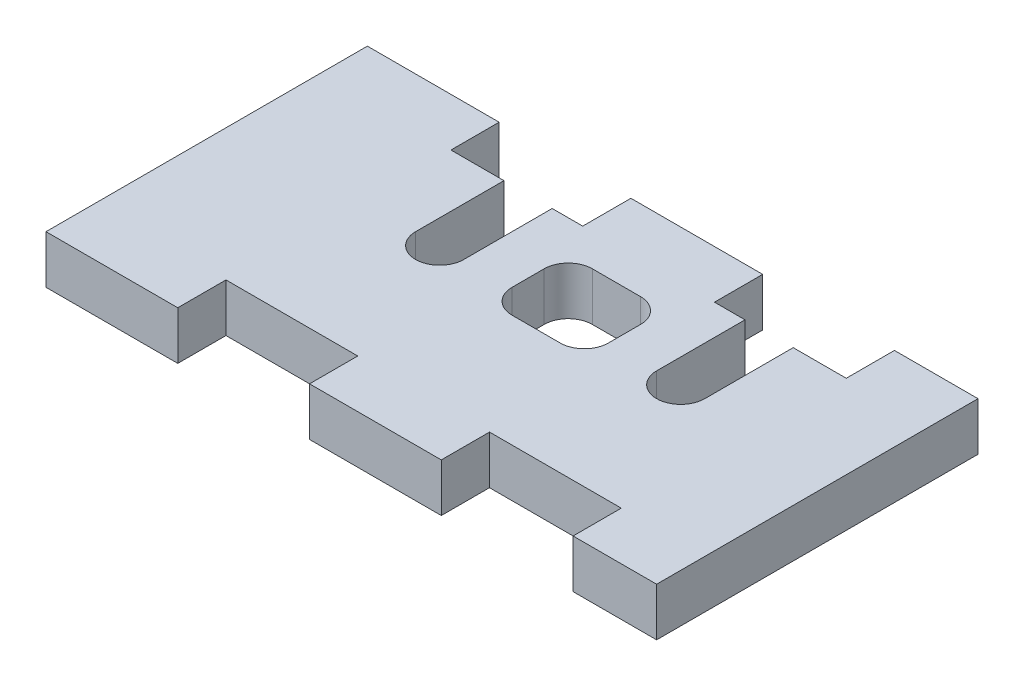
ISO-10303-21;
HEADER;
FILE_DESCRIPTION(('STEP AP214'),'2;1');
FILE_NAME('part.step','',(''),(''),'','','');
FILE_SCHEMA(('AUTOMOTIVE_DESIGN { 1 0 10303 214 1 1 1 1 }'));
ENDSEC;
DATA;
#1=APPLICATION_CONTEXT('core data for automotive mechanical design processes');
#2=APPLICATION_PROTOCOL_DEFINITION('international standard','automotive_design',2000,#1);
#3=PRODUCT_CONTEXT('',#1,'mechanical');
#4=PRODUCT('Part','Part','',(#3));
#5=PRODUCT_RELATED_PRODUCT_CATEGORY('part','',(#4));
#6=PRODUCT_DEFINITION_FORMATION('','',#4);
#7=PRODUCT_DEFINITION_CONTEXT('part definition',#1,'design');
#8=PRODUCT_DEFINITION('design','',#6,#7);
#9=PRODUCT_DEFINITION_SHAPE('','',#8);
#10=(LENGTH_UNIT() NAMED_UNIT(*) SI_UNIT(.MILLI.,.METRE.));
#11=(NAMED_UNIT(*) PLANE_ANGLE_UNIT() SI_UNIT($,.RADIAN.));
#12=(NAMED_UNIT(*) SI_UNIT($,.STERADIAN.) SOLID_ANGLE_UNIT());
#13=UNCERTAINTY_MEASURE_WITH_UNIT(LENGTH_MEASURE(1.E-05),#10,'distance_accuracy_value','');
#14=(GEOMETRIC_REPRESENTATION_CONTEXT(3) GLOBAL_UNCERTAINTY_ASSIGNED_CONTEXT((#13)) GLOBAL_UNIT_ASSIGNED_CONTEXT((#10,
#11,#12)) REPRESENTATION_CONTEXT('',''));
#15=CARTESIAN_POINT('',(0.,0.,0.));
#16=DIRECTION('',(0.,0.,1.));
#17=DIRECTION('',(1.,0.,0.));
#18=AXIS2_PLACEMENT_3D('',#15,#16,#17);
#19=CARTESIAN_POINT('',(24.599646,3.,-17.000006));
#20=DIRECTION('',(0.,0.,1.));
#21=DIRECTION('',(1.,0.,0.));
#22=AXIS2_PLACEMENT_3D('',#19,#20,#21);
#23=PLANE('',#22);
#24=DIRECTION('',(-1.,0.,0.));
#25=VECTOR('',#24,1.);
#26=CARTESIAN_POINT('',(24.599646,3.,-17.000006));
#27=LINE('',#26,#25);
#28=CARTESIAN_POINT('',(26.499959,3.,-17.000006));
#29=VERTEX_POINT('',#28);
#30=CARTESIAN_POINT('',(24.599646,3.,-17.000006));
#31=VERTEX_POINT('',#30);
#32=EDGE_CURVE('E421',#29,#31,#27,.T.);
#33=ORIENTED_EDGE('',*,*,#32,.F.);
#34=DIRECTION('',(0.,1.,0.));
#35=VECTOR('',#34,1.);
#36=CARTESIAN_POINT('',(26.499959,3.001,-17.000006));
#37=LINE('',#36,#35);
#38=CARTESIAN_POINT('',(26.499959,0.,-17.000006));
#39=VERTEX_POINT('',#38);
#40=EDGE_CURVE('E562',#39,#29,#37,.T.);
#41=ORIENTED_EDGE('',*,*,#40,.F.);
#42=DIRECTION('',(-1.,0.,0.));
#43=VECTOR('',#42,1.);
#44=CARTESIAN_POINT('',(24.599646,0.,-17.000006));
#45=LINE('',#44,#43);
#46=CARTESIAN_POINT('',(24.599646,0.,-17.000006));
#47=VERTEX_POINT('',#46);
#48=EDGE_CURVE('E325',#39,#47,#45,.T.);
#49=ORIENTED_EDGE('',*,*,#48,.T.);
#50=DIRECTION('',(0.,-1.,0.));
#51=VECTOR('',#50,1.);
#52=CARTESIAN_POINT('',(24.599646,3.,-17.000006));
#53=LINE('',#52,#51);
#54=EDGE_CURVE('E467',#31,#47,#53,.T.);
#55=ORIENTED_EDGE('',*,*,#54,.F.);
#56=EDGE_LOOP('',(#33,#41,#49,#55));
#57=FACE_BOUND('',#56,.T.);
#58=ADVANCED_FACE('F33',(#57),#23,.F.);
#59=CARTESIAN_POINT('',(8.19937400000001,3.,-17.000006));
#60=DIRECTION('',(0.,0.,1.));
#61=DIRECTION('',(1.,0.,0.));
#62=AXIS2_PLACEMENT_3D('',#59,#60,#61);
#63=PLANE('',#62);
#64=DIRECTION('',(-1.,0.,0.));
#65=VECTOR('',#64,1.);
#66=CARTESIAN_POINT('',(8.19937400000001,0.,-17.000006));
#67=LINE('',#66,#65);
#68=CARTESIAN_POINT('',(16.400272,0.,-17.000006));
#69=VERTEX_POINT('',#68);
#70=CARTESIAN_POINT('',(14.499959,0.,-17.000006));
#71=VERTEX_POINT('',#70);
#72=EDGE_CURVE('E292',#69,#71,#67,.T.);
#73=ORIENTED_EDGE('',*,*,#72,.T.);
#74=DIRECTION('',(0.,-1.,0.));
#75=VECTOR('',#74,1.);
#76=CARTESIAN_POINT('',(14.499959,3.001,-17.000006));
#77=LINE('',#76,#75);
#78=CARTESIAN_POINT('',(14.499959,3.,-17.000006));
#79=VERTEX_POINT('',#78);
#80=EDGE_CURVE('E283',#79,#71,#77,.T.);
#81=ORIENTED_EDGE('',*,*,#80,.F.);
#82=DIRECTION('',(-1.,0.,0.));
#83=VECTOR('',#82,1.);
#84=CARTESIAN_POINT('',(8.19937400000001,3.,-17.000006));
#85=LINE('',#84,#83);
#86=CARTESIAN_POINT('',(16.400272,3.,-17.000006));
#87=VERTEX_POINT('',#86);
#88=EDGE_CURVE('E431',#87,#79,#85,.T.);
#89=ORIENTED_EDGE('',*,*,#88,.F.);
#90=DIRECTION('',(0.,-1.,0.));
#91=VECTOR('',#90,1.);
#92=CARTESIAN_POINT('',(16.400272,3.,-17.000006));
#93=LINE('',#92,#91);
#94=EDGE_CURVE('E458',#87,#69,#93,.T.);
#95=ORIENTED_EDGE('',*,*,#94,.T.);
#96=EDGE_LOOP('',(#73,#81,#89,#95));
#97=FACE_BOUND('',#96,.T.);
#98=ADVANCED_FACE('F668',(#97),#63,.F.);
#99=CARTESIAN_POINT('',(0.,3.,0.));
#100=DIRECTION('',(1.,0.,0.));
#101=DIRECTION('',(0.,0.,-1.));
#102=AXIS2_PLACEMENT_3D('',#99,#100,#101);
#103=PLANE('',#102);
#104=DIRECTION('',(0.,0.,1.));
#105=VECTOR('',#104,1.);
#106=CARTESIAN_POINT('',(0.,0.,0.));
#107=LINE('',#106,#105);
#108=CARTESIAN_POINT('',(0.,0.,-20.));
#109=VERTEX_POINT('',#108);
#110=CARTESIAN_POINT('',(0.,0.,0.));
#111=VERTEX_POINT('',#110);
#112=EDGE_CURVE('E392',#109,#111,#107,.T.);
#113=ORIENTED_EDGE('',*,*,#112,.T.);
#114=DIRECTION('',(0.,-1.,0.));
#115=VECTOR('',#114,1.);
#116=CARTESIAN_POINT('',(0.,3.,0.));
#117=LINE('',#116,#115);
#118=CARTESIAN_POINT('',(0.,3.,0.));
#119=VERTEX_POINT('',#118);
#120=EDGE_CURVE('E12',#119,#111,#117,.T.);
#121=ORIENTED_EDGE('',*,*,#120,.F.);
#122=DIRECTION('',(0.,0.,1.));
#123=VECTOR('',#122,1.);
#124=CARTESIAN_POINT('',(0.,3.,0.));
#125=LINE('',#124,#123);
#126=CARTESIAN_POINT('',(0.,3.,-20.));
#127=VERTEX_POINT('',#126);
#128=EDGE_CURVE('E393',#127,#119,#125,.T.);
#129=ORIENTED_EDGE('',*,*,#128,.F.);
#130=DIRECTION('',(0.,-1.,0.));
#131=VECTOR('',#130,1.);
#132=CARTESIAN_POINT('',(0.,3.,-20.));
#133=LINE('',#132,#131);
#134=EDGE_CURVE('E438',#127,#109,#133,.T.);
#135=ORIENTED_EDGE('',*,*,#134,.T.);
#136=EDGE_LOOP('',(#113,#121,#129,#135));
#137=FACE_BOUND('',#136,.T.);
#138=ADVANCED_FACE('F35',(#137),#103,.F.);
#139=CARTESIAN_POINT('',(0.,3.,0.));
#140=DIRECTION('',(0.,0.,-1.));
#141=DIRECTION('',(-1.,0.,0.));
#142=AXIS2_PLACEMENT_3D('',#139,#140,#141);
#143=PLANE('',#142);
#144=DIRECTION('',(1.,0.,0.));
#145=VECTOR('',#144,1.);
#146=CARTESIAN_POINT('',(0.,0.,0.));
#147=LINE('',#146,#145);
#148=CARTESIAN_POINT('',(8.19937400000001,0.,0.));
#149=VERTEX_POINT('',#148);
#150=EDGE_CURVE('E442',#111,#149,#147,.T.);
#151=ORIENTED_EDGE('',*,*,#150,.T.);
#152=DIRECTION('',(0.,-1.,0.));
#153=VECTOR('',#152,1.);
#154=CARTESIAN_POINT('',(8.19937400000001,3.,0.));
#155=LINE('',#154,#153);
#156=CARTESIAN_POINT('',(8.19937400000001,3.,0.));
#157=VERTEX_POINT('',#156);
#158=EDGE_CURVE('E41',#157,#149,#155,.T.);
#159=ORIENTED_EDGE('',*,*,#158,.F.);
#160=DIRECTION('',(1.,0.,0.));
#161=VECTOR('',#160,1.);
#162=CARTESIAN_POINT('',(0.,3.,0.));
#163=LINE('',#162,#161);
#164=EDGE_CURVE('E396',#119,#157,#163,.T.);
#165=ORIENTED_EDGE('',*,*,#164,.F.);
#166=ORIENTED_EDGE('',*,*,#120,.T.);
#167=EDGE_LOOP('',(#151,#159,#165,#166));
#168=FACE_BOUND('',#167,.T.);
#169=ADVANCED_FACE('F979',(#168),#143,.F.);
#170=CARTESIAN_POINT('',(8.19937400000001,3.,-3.00024800000001));
#171=DIRECTION('',(-1.,0.,0.));
#172=DIRECTION('',(0.,0.,1.));
#173=AXIS2_PLACEMENT_3D('',#170,#171,#172);
#174=PLANE('',#173);
#175=DIRECTION('',(0.,0.,-1.));
#176=VECTOR('',#175,1.);
#177=CARTESIAN_POINT('',(8.19937400000001,0.,-3.00024800000001));
#178=LINE('',#177,#176);
#179=CARTESIAN_POINT('',(8.19937400000001,0.,-3.00024800000001));
#180=VERTEX_POINT('',#179);
#181=EDGE_CURVE('E509',#149,#180,#178,.T.);
#182=ORIENTED_EDGE('',*,*,#181,.T.);
#183=DIRECTION('',(0.,-1.,0.));
#184=VECTOR('',#183,1.);
#185=CARTESIAN_POINT('',(8.19937400000001,3.,-3.00024800000001));
#186=LINE('',#185,#184);
#187=CARTESIAN_POINT('',(8.19937400000001,3.,-3.00024800000001));
#188=VERTEX_POINT('',#187);
#189=EDGE_CURVE('E500',#188,#180,#186,.T.);
#190=ORIENTED_EDGE('',*,*,#189,.F.);
#191=DIRECTION('',(0.,0.,-1.));
#192=VECTOR('',#191,1.);
#193=CARTESIAN_POINT('',(8.19937400000001,3.,-3.00024800000001));
#194=LINE('',#193,#192);
#195=EDGE_CURVE('E399',#157,#188,#194,.T.);
#196=ORIENTED_EDGE('',*,*,#195,.F.);
#197=ORIENTED_EDGE('',*,*,#158,.T.);
#198=EDGE_LOOP('',(#182,#190,#196,#197));
#199=FACE_BOUND('',#198,.T.);
#200=ADVANCED_FACE('F507',(#199),#174,.F.);
#201=CARTESIAN_POINT('',(8.19937400000001,3.,-3.00024800000001));
#202=DIRECTION('',(0.,0.,-1.));
#203=DIRECTION('',(-1.,0.,0.));
#204=AXIS2_PLACEMENT_3D('',#201,#202,#203);
#205=PLANE('',#204);
#206=DIRECTION('',(1.,0.,0.));
#207=VECTOR('',#206,1.);
#208=CARTESIAN_POINT('',(8.19937400000001,0.,-3.00024800000001));
#209=LINE('',#208,#207);
#210=CARTESIAN_POINT('',(16.400272,0.,-3.00024800000001));
#211=VERTEX_POINT('',#210);
#212=EDGE_CURVE('E514',#180,#211,#209,.T.);
#213=ORIENTED_EDGE('',*,*,#212,.T.);
#214=DIRECTION('',(0.,-1.,0.));
#215=VECTOR('',#214,1.);
#216=CARTESIAN_POINT('',(16.400272,3.,-3.00024800000001));
#217=LINE('',#216,#215);
#218=CARTESIAN_POINT('',(16.400272,3.,-3.00024800000001));
#219=VERTEX_POINT('',#218);
#220=EDGE_CURVE('E497',#219,#211,#217,.T.);
#221=ORIENTED_EDGE('',*,*,#220,.F.);
#222=DIRECTION('',(1.,0.,0.));
#223=VECTOR('',#222,1.);
#224=CARTESIAN_POINT('',(8.19937400000001,3.,-3.00024800000001));
#225=LINE('',#224,#223);
#226=EDGE_CURVE('E401',#188,#219,#225,.T.);
#227=ORIENTED_EDGE('',*,*,#226,.F.);
#228=ORIENTED_EDGE('',*,*,#189,.T.);
#229=EDGE_LOOP('',(#213,#221,#227,#228));
#230=FACE_BOUND('',#229,.T.);
#231=ADVANCED_FACE('F962',(#230),#205,.F.);
#232=CARTESIAN_POINT('',(16.400272,3.,-3.00024800000001));
#233=DIRECTION('',(1.,0.,0.));
#234=DIRECTION('',(0.,0.,-1.));
#235=AXIS2_PLACEMENT_3D('',#232,#233,#234);
#236=PLANE('',#235);
#237=DIRECTION('',(0.,0.,1.));
#238=VECTOR('',#237,1.);
#239=CARTESIAN_POINT('',(16.400272,0.,-3.00024800000001));
#240=LINE('',#239,#238);
#241=CARTESIAN_POINT('',(16.400272,0.,0.));
#242=VERTEX_POINT('',#241);
#243=EDGE_CURVE('E515',#211,#242,#240,.T.);
#244=ORIENTED_EDGE('',*,*,#243,.T.);
#245=DIRECTION('',(0.,-1.,0.));
#246=VECTOR('',#245,1.);
#247=CARTESIAN_POINT('',(16.400272,3.,0.));
#248=LINE('',#247,#246);
#249=CARTESIAN_POINT('',(16.400272,3.,0.));
#250=VERTEX_POINT('',#249);
#251=EDGE_CURVE('E494',#250,#242,#248,.T.);
#252=ORIENTED_EDGE('',*,*,#251,.F.);
#253=DIRECTION('',(0.,0.,1.));
#254=VECTOR('',#253,1.);
#255=CARTESIAN_POINT('',(16.400272,3.,-3.00024800000001));
#256=LINE('',#255,#254);
#257=EDGE_CURVE('E403',#219,#250,#256,.T.);
#258=ORIENTED_EDGE('',*,*,#257,.F.);
#259=ORIENTED_EDGE('',*,*,#220,.T.);
#260=EDGE_LOOP('',(#244,#252,#258,#259));
#261=FACE_BOUND('',#260,.T.);
#262=ADVANCED_FACE('F953',(#261),#236,.F.);
#263=CARTESIAN_POINT('',(16.400272,3.,0.));
#264=DIRECTION('',(0.,0.,-1.));
#265=DIRECTION('',(-1.,0.,0.));
#266=AXIS2_PLACEMENT_3D('',#263,#264,#265);
#267=PLANE('',#266);
#268=DIRECTION('',(1.,0.,0.));
#269=VECTOR('',#268,1.);
#270=CARTESIAN_POINT('',(16.400272,0.,0.));
#271=LINE('',#270,#269);
#272=CARTESIAN_POINT('',(24.599646,0.,0.));
#273=VERTEX_POINT('',#272);
#274=EDGE_CURVE('E526',#242,#273,#271,.T.);
#275=ORIENTED_EDGE('',*,*,#274,.T.);
#276=DIRECTION('',(0.,-1.,0.));
#277=VECTOR('',#276,1.);
#278=CARTESIAN_POINT('',(24.599646,3.,0.));
#279=LINE('',#278,#277);
#280=CARTESIAN_POINT('',(24.599646,3.,0.));
#281=VERTEX_POINT('',#280);
#282=EDGE_CURVE('E491',#281,#273,#279,.T.);
#283=ORIENTED_EDGE('',*,*,#282,.F.);
#284=DIRECTION('',(1.,0.,0.));
#285=VECTOR('',#284,1.);
#286=CARTESIAN_POINT('',(16.400272,3.,0.));
#287=LINE('',#286,#285);
#288=EDGE_CURVE('E405',#250,#281,#287,.T.);
#289=ORIENTED_EDGE('',*,*,#288,.F.);
#290=ORIENTED_EDGE('',*,*,#251,.T.);
#291=EDGE_LOOP('',(#275,#283,#289,#290));
#292=FACE_BOUND('',#291,.T.);
#293=ADVANCED_FACE('F944',(#292),#267,.F.);
#294=CARTESIAN_POINT('',(24.599646,3.,-3.00024800000001));
#295=DIRECTION('',(-1.,0.,0.));
#296=DIRECTION('',(0.,0.,1.));
#297=AXIS2_PLACEMENT_3D('',#294,#295,#296);
#298=PLANE('',#297);
#299=DIRECTION('',(0.,0.,-1.));
#300=VECTOR('',#299,1.);
#301=CARTESIAN_POINT('',(24.599646,0.,-3.00024800000001));
#302=LINE('',#301,#300);
#303=CARTESIAN_POINT('',(24.599646,0.,-3.00024800000001));
#304=VERTEX_POINT('',#303);
#305=EDGE_CURVE('E529',#273,#304,#302,.T.);
#306=ORIENTED_EDGE('',*,*,#305,.T.);
#307=DIRECTION('',(0.,-1.,0.));
#308=VECTOR('',#307,1.);
#309=CARTESIAN_POINT('',(24.599646,3.,-3.00024800000001));
#310=LINE('',#309,#308);
#311=CARTESIAN_POINT('',(24.599646,3.,-3.00024800000001));
#312=VERTEX_POINT('',#311);
#313=EDGE_CURVE('E488',#312,#304,#310,.T.);
#314=ORIENTED_EDGE('',*,*,#313,.F.);
#315=DIRECTION('',(0.,0.,-1.));
#316=VECTOR('',#315,1.);
#317=CARTESIAN_POINT('',(24.599646,3.,-3.00024800000001));
#318=LINE('',#317,#316);
#319=EDGE_CURVE('E407',#281,#312,#318,.T.);
#320=ORIENTED_EDGE('',*,*,#319,.F.);
#321=ORIENTED_EDGE('',*,*,#282,.T.);
#322=EDGE_LOOP('',(#306,#314,#320,#321));
#323=FACE_BOUND('',#322,.T.);
#324=ADVANCED_FACE('F935',(#323),#298,.F.);
#325=CARTESIAN_POINT('',(24.599646,3.,-3.00024800000001));
#326=DIRECTION('',(0.,0.,-1.));
#327=DIRECTION('',(-1.,0.,0.));
#328=AXIS2_PLACEMENT_3D('',#325,#326,#327);
#329=PLANE('',#328);
#330=DIRECTION('',(1.,0.,0.));
#331=VECTOR('',#330,1.);
#332=CARTESIAN_POINT('',(24.599646,0.,-3.00024800000001));
#333=LINE('',#332,#331);
#334=CARTESIAN_POINT('',(32.80029,0.,-3.00024800000001));
#335=VERTEX_POINT('',#334);
#336=EDGE_CURVE('E532',#304,#335,#333,.T.);
#337=ORIENTED_EDGE('',*,*,#336,.T.);
#338=DIRECTION('',(0.,-1.,0.));
#339=VECTOR('',#338,1.);
#340=CARTESIAN_POINT('',(32.80029,3.,-3.00024800000001));
#341=LINE('',#340,#339);
#342=CARTESIAN_POINT('',(32.80029,3.,-3.00024800000001));
#343=VERTEX_POINT('',#342);
#344=EDGE_CURVE('E485',#343,#335,#341,.T.);
#345=ORIENTED_EDGE('',*,*,#344,.F.);
#346=DIRECTION('',(1.,0.,0.));
#347=VECTOR('',#346,1.);
#348=CARTESIAN_POINT('',(24.599646,3.,-3.00024800000001));
#349=LINE('',#348,#347);
#350=EDGE_CURVE('E409',#312,#343,#349,.T.);
#351=ORIENTED_EDGE('',*,*,#350,.F.);
#352=ORIENTED_EDGE('',*,*,#313,.T.);
#353=EDGE_LOOP('',(#337,#345,#351,#352));
#354=FACE_BOUND('',#353,.T.);
#355=ADVANCED_FACE('F926',(#354),#329,.F.);
#356=CARTESIAN_POINT('',(32.80029,3.,-3.00024800000001));
#357=DIRECTION('',(1.,0.,0.));
#358=DIRECTION('',(0.,0.,-1.));
#359=AXIS2_PLACEMENT_3D('',#356,#357,#358);
#360=PLANE('',#359);
#361=DIRECTION('',(0.,0.,1.));
#362=VECTOR('',#361,1.);
#363=CARTESIAN_POINT('',(32.80029,0.,-3.00024800000001));
#364=LINE('',#363,#362);
#365=CARTESIAN_POINT('',(32.80029,0.,0.));
#366=VERTEX_POINT('',#365);
#367=EDGE_CURVE('E540',#335,#366,#364,.T.);
#368=ORIENTED_EDGE('',*,*,#367,.T.);
#369=DIRECTION('',(0.,-1.,0.));
#370=VECTOR('',#369,1.);
#371=CARTESIAN_POINT('',(32.80029,3.,0.));
#372=LINE('',#371,#370);
#373=CARTESIAN_POINT('',(32.80029,3.,0.));
#374=VERTEX_POINT('',#373);
#375=EDGE_CURVE('E482',#374,#366,#372,.T.);
#376=ORIENTED_EDGE('',*,*,#375,.F.);
#377=DIRECTION('',(0.,0.,1.));
#378=VECTOR('',#377,1.);
#379=CARTESIAN_POINT('',(32.80029,3.,-3.00024800000001));
#380=LINE('',#379,#378);
#381=EDGE_CURVE('E411',#343,#374,#380,.T.);
#382=ORIENTED_EDGE('',*,*,#381,.F.);
#383=ORIENTED_EDGE('',*,*,#344,.T.);
#384=EDGE_LOOP('',(#368,#376,#382,#383));
#385=FACE_BOUND('',#384,.T.);
#386=ADVANCED_FACE('F917',(#385),#360,.F.);
#387=CARTESIAN_POINT('',(32.80029,3.,0.));
#388=DIRECTION('',(0.,0.,-1.));
#389=DIRECTION('',(-1.,0.,0.));
#390=AXIS2_PLACEMENT_3D('',#387,#388,#389);
#391=PLANE('',#390);
#392=DIRECTION('',(1.,0.,0.));
#393=VECTOR('',#392,1.);
#394=CARTESIAN_POINT('',(32.80029,0.,0.));
#395=LINE('',#394,#393);
#396=CARTESIAN_POINT('',(37.999416,0.,0.));
#397=VERTEX_POINT('',#396);
#398=EDGE_CURVE('E542',#366,#397,#395,.T.);
#399=ORIENTED_EDGE('',*,*,#398,.T.);
#400=DIRECTION('',(0.,-1.,0.));
#401=VECTOR('',#400,1.);
#402=CARTESIAN_POINT('',(37.999416,3.,0.));
#403=LINE('',#402,#401);
#404=CARTESIAN_POINT('',(37.999416,3.,0.));
#405=VERTEX_POINT('',#404);
#406=EDGE_CURVE('E479',#405,#397,#403,.T.);
#407=ORIENTED_EDGE('',*,*,#406,.F.);
#408=DIRECTION('',(1.,0.,0.));
#409=VECTOR('',#408,1.);
#410=CARTESIAN_POINT('',(32.80029,3.,0.));
#411=LINE('',#410,#409);
#412=EDGE_CURVE('E413',#374,#405,#411,.T.);
#413=ORIENTED_EDGE('',*,*,#412,.F.);
#414=ORIENTED_EDGE('',*,*,#375,.T.);
#415=EDGE_LOOP('',(#399,#407,#413,#414));
#416=FACE_BOUND('',#415,.T.);
#417=ADVANCED_FACE('F908',(#416),#391,.F.);
#418=CARTESIAN_POINT('',(37.999416,3.,0.));
#419=DIRECTION('',(-1.,0.,0.));
#420=DIRECTION('',(0.,0.,1.));
#421=AXIS2_PLACEMENT_3D('',#418,#419,#420);
#422=PLANE('',#421);
#423=DIRECTION('',(0.,0.,-1.));
#424=VECTOR('',#423,1.);
#425=CARTESIAN_POINT('',(37.999416,0.,0.));
#426=LINE('',#425,#424);
#427=CARTESIAN_POINT('',(37.999416,0.,-20.));
#428=VERTEX_POINT('',#427);
#429=EDGE_CURVE('E545',#397,#428,#426,.T.);
#430=ORIENTED_EDGE('',*,*,#429,.T.);
#431=DIRECTION('',(0.,-1.,0.));
#432=VECTOR('',#431,1.);
#433=CARTESIAN_POINT('',(37.999416,3.,-20.));
#434=LINE('',#433,#432);
#435=CARTESIAN_POINT('',(37.999416,3.,-20.));
#436=VERTEX_POINT('',#435);
#437=EDGE_CURVE('E476',#436,#428,#434,.T.);
#438=ORIENTED_EDGE('',*,*,#437,.F.);
#439=DIRECTION('',(0.,0.,-1.));
#440=VECTOR('',#439,1.);
#441=CARTESIAN_POINT('',(37.999416,3.,0.));
#442=LINE('',#441,#440);
#443=EDGE_CURVE('E415',#405,#436,#442,.T.);
#444=ORIENTED_EDGE('',*,*,#443,.F.);
#445=ORIENTED_EDGE('',*,*,#406,.T.);
#446=EDGE_LOOP('',(#430,#438,#444,#445));
#447=FACE_BOUND('',#446,.T.);
#448=ADVANCED_FACE('F900',(#447),#422,.F.);
#449=CARTESIAN_POINT('',(32.80029,3.,-20.));
#450=DIRECTION('',(0.,0.,1.));
#451=DIRECTION('',(1.,0.,0.));
#452=AXIS2_PLACEMENT_3D('',#449,#450,#451);
#453=PLANE('',#452);
#454=DIRECTION('',(-1.,0.,0.));
#455=VECTOR('',#454,1.);
#456=CARTESIAN_POINT('',(32.80029,0.,-20.));
#457=LINE('',#456,#455);
#458=CARTESIAN_POINT('',(32.80029,0.,-20.));
#459=VERTEX_POINT('',#458);
#460=EDGE_CURVE('E547',#428,#459,#457,.T.);
#461=ORIENTED_EDGE('',*,*,#460,.T.);
#462=DIRECTION('',(0.,-1.,0.));
#463=VECTOR('',#462,1.);
#464=CARTESIAN_POINT('',(32.80029,3.,-20.));
#465=LINE('',#464,#463);
#466=CARTESIAN_POINT('',(32.80029,3.,-20.));
#467=VERTEX_POINT('',#466);
#468=EDGE_CURVE('E473',#467,#459,#465,.T.);
#469=ORIENTED_EDGE('',*,*,#468,.F.);
#470=DIRECTION('',(-1.,0.,0.));
#471=VECTOR('',#470,1.);
#472=CARTESIAN_POINT('',(32.80029,3.,-20.));
#473=LINE('',#472,#471);
#474=EDGE_CURVE('E417',#436,#467,#473,.T.);
#475=ORIENTED_EDGE('',*,*,#474,.F.);
#476=ORIENTED_EDGE('',*,*,#437,.T.);
#477=EDGE_LOOP('',(#461,#469,#475,#476));
#478=FACE_BOUND('',#477,.T.);
#479=ADVANCED_FACE('F685',(#478),#453,.F.);
#480=CARTESIAN_POINT('',(32.80029,3.,-20.));
#481=DIRECTION('',(1.,0.,0.));
#482=DIRECTION('',(0.,0.,-1.));
#483=AXIS2_PLACEMENT_3D('',#480,#481,#482);
#484=PLANE('',#483);
#485=DIRECTION('',(0.,0.,1.));
#486=VECTOR('',#485,1.);
#487=CARTESIAN_POINT('',(32.80029,0.,-20.));
#488=LINE('',#487,#486);
#489=CARTESIAN_POINT('',(32.80029,0.,-17.000006));
#490=VERTEX_POINT('',#489);
#491=EDGE_CURVE('E326',#459,#490,#488,.T.);
#492=ORIENTED_EDGE('',*,*,#491,.T.);
#493=DIRECTION('',(0.,-1.,0.));
#494=VECTOR('',#493,1.);
#495=CARTESIAN_POINT('',(32.80029,3.,-17.000006));
#496=LINE('',#495,#494);
#497=CARTESIAN_POINT('',(32.80029,3.,-17.000006));
#498=VERTEX_POINT('',#497);
#499=EDGE_CURVE('E470',#498,#490,#496,.T.);
#500=ORIENTED_EDGE('',*,*,#499,.F.);
#501=DIRECTION('',(0.,0.,1.));
#502=VECTOR('',#501,1.);
#503=CARTESIAN_POINT('',(32.80029,3.,-20.));
#504=LINE('',#503,#502);
#505=EDGE_CURVE('E419',#467,#498,#504,.T.);
#506=ORIENTED_EDGE('',*,*,#505,.F.);
#507=ORIENTED_EDGE('',*,*,#468,.T.);
#508=EDGE_LOOP('',(#492,#500,#506,#507));
#509=FACE_BOUND('',#508,.T.);
#510=ADVANCED_FACE('F679',(#509),#484,.F.);
#511=CARTESIAN_POINT('',(29.499959,0.,-17.000006));
#512=VERTEX_POINT('',#511);
#513=EDGE_CURVE('E321',#490,#512,#45,.T.);
#514=ORIENTED_EDGE('',*,*,#513,.T.);
#515=DIRECTION('',(0.,-1.,0.));
#516=VECTOR('',#515,1.);
#517=CARTESIAN_POINT('',(29.499959,3.001,-17.000006));
#518=LINE('',#517,#516);
#519=CARTESIAN_POINT('',(29.499959,3.,-17.000006));
#520=VERTEX_POINT('',#519);
#521=EDGE_CURVE('E689',#520,#512,#518,.T.);
#522=ORIENTED_EDGE('',*,*,#521,.F.);
#523=EDGE_CURVE('E422',#498,#520,#27,.T.);
#524=ORIENTED_EDGE('',*,*,#523,.F.);
#525=ORIENTED_EDGE('',*,*,#499,.T.);
#526=EDGE_LOOP('',(#514,#522,#524,#525));
#527=FACE_BOUND('',#526,.T.);
#528=ADVANCED_FACE('F670',(#527),#23,.F.);
#529=CARTESIAN_POINT('',(24.599646,3.,-20.));
#530=DIRECTION('',(-1.,0.,0.));
#531=DIRECTION('',(0.,0.,1.));
#532=AXIS2_PLACEMENT_3D('',#529,#530,#531);
#533=PLANE('',#532);
#534=DIRECTION('',(0.,0.,-1.));
#535=VECTOR('',#534,1.);
#536=CARTESIAN_POINT('',(24.599646,0.,-20.));
#537=LINE('',#536,#535);
#538=CARTESIAN_POINT('',(24.599646,0.,-20.));
#539=VERTEX_POINT('',#538);
#540=EDGE_CURVE('E318',#47,#539,#537,.T.);
#541=ORIENTED_EDGE('',*,*,#540,.T.);
#542=DIRECTION('',(0.,-1.,0.));
#543=VECTOR('',#542,1.);
#544=CARTESIAN_POINT('',(24.599646,3.,-20.));
#545=LINE('',#544,#543);
#546=CARTESIAN_POINT('',(24.599646,3.,-20.));
#547=VERTEX_POINT('',#546);
#548=EDGE_CURVE('E464',#547,#539,#545,.T.);
#549=ORIENTED_EDGE('',*,*,#548,.F.);
#550=DIRECTION('',(0.,0.,-1.));
#551=VECTOR('',#550,1.);
#552=CARTESIAN_POINT('',(24.599646,3.,-20.));
#553=LINE('',#552,#551);
#554=EDGE_CURVE('E425',#31,#547,#553,.T.);
#555=ORIENTED_EDGE('',*,*,#554,.F.);
#556=ORIENTED_EDGE('',*,*,#54,.T.);
#557=EDGE_LOOP('',(#541,#549,#555,#556));
#558=FACE_BOUND('',#557,.T.);
#559=ADVANCED_FACE('F565',(#558),#533,.F.);
#560=CARTESIAN_POINT('',(16.400272,3.,-20.));
#561=DIRECTION('',(0.,0.,1.));
#562=DIRECTION('',(1.,0.,0.));
#563=AXIS2_PLACEMENT_3D('',#560,#561,#562);
#564=PLANE('',#563);
#565=DIRECTION('',(-1.,0.,0.));
#566=VECTOR('',#565,1.);
#567=CARTESIAN_POINT('',(16.400272,0.,-20.));
#568=LINE('',#567,#566);
#569=CARTESIAN_POINT('',(16.400272,0.,-20.));
#570=VERTEX_POINT('',#569);
#571=EDGE_CURVE('E296',#539,#570,#568,.T.);
#572=ORIENTED_EDGE('',*,*,#571,.T.);
#573=DIRECTION('',(0.,-1.,0.));
#574=VECTOR('',#573,1.);
#575=CARTESIAN_POINT('',(16.400272,3.,-20.));
#576=LINE('',#575,#574);
#577=CARTESIAN_POINT('',(16.400272,3.,-20.));
#578=VERTEX_POINT('',#577);
#579=EDGE_CURVE('E461',#578,#570,#576,.T.);
#580=ORIENTED_EDGE('',*,*,#579,.F.);
#581=DIRECTION('',(-1.,0.,0.));
#582=VECTOR('',#581,1.);
#583=CARTESIAN_POINT('',(16.400272,3.,-20.));
#584=LINE('',#583,#582);
#585=EDGE_CURVE('E427',#547,#578,#584,.T.);
#586=ORIENTED_EDGE('',*,*,#585,.F.);
#587=ORIENTED_EDGE('',*,*,#548,.T.);
#588=EDGE_LOOP('',(#572,#580,#586,#587));
#589=FACE_BOUND('',#588,.T.);
#590=ADVANCED_FACE('F572',(#589),#564,.F.);
#591=CARTESIAN_POINT('',(16.400272,3.,-20.));
#592=DIRECTION('',(1.,0.,0.));
#593=DIRECTION('',(0.,0.,-1.));
#594=AXIS2_PLACEMENT_3D('',#591,#592,#593);
#595=PLANE('',#594);
#596=DIRECTION('',(0.,0.,1.));
#597=VECTOR('',#596,1.);
#598=CARTESIAN_POINT('',(16.400272,0.,-20.));
#599=LINE('',#598,#597);
#600=EDGE_CURVE('E293',#570,#69,#599,.T.);
#601=ORIENTED_EDGE('',*,*,#600,.T.);
#602=ORIENTED_EDGE('',*,*,#94,.F.);
#603=DIRECTION('',(0.,0.,1.));
#604=VECTOR('',#603,1.);
#605=CARTESIAN_POINT('',(16.400272,3.,-20.));
#606=LINE('',#605,#604);
#607=EDGE_CURVE('E429',#578,#87,#606,.T.);
#608=ORIENTED_EDGE('',*,*,#607,.F.);
#609=ORIENTED_EDGE('',*,*,#579,.T.);
#610=EDGE_LOOP('',(#601,#602,#608,#609));
#611=FACE_BOUND('',#610,.T.);
#612=ADVANCED_FACE('F576',(#611),#595,.F.);
#613=CARTESIAN_POINT('',(11.499959,3.,-17.000006));
#614=VERTEX_POINT('',#613);
#615=CARTESIAN_POINT('',(8.19937400000001,3.,-17.000006));
#616=VERTEX_POINT('',#615);
#617=EDGE_CURVE('E282',#614,#616,#85,.T.);
#618=ORIENTED_EDGE('',*,*,#617,.F.);
#619=DIRECTION('',(0.,1.,0.));
#620=VECTOR('',#619,1.);
#621=CARTESIAN_POINT('',(11.499959,3.001,-17.000006));
#622=LINE('',#621,#620);
#623=CARTESIAN_POINT('',(11.499959,0.,-17.000006));
#624=VERTEX_POINT('',#623);
#625=EDGE_CURVE('E269',#624,#614,#622,.T.);
#626=ORIENTED_EDGE('',*,*,#625,.F.);
#627=CARTESIAN_POINT('',(8.19937400000001,0.,-17.000006));
#628=VERTEX_POINT('',#627);
#629=EDGE_CURVE('E280',#624,#628,#67,.T.);
#630=ORIENTED_EDGE('',*,*,#629,.T.);
#631=DIRECTION('',(0.,-1.,0.));
#632=VECTOR('',#631,1.);
#633=CARTESIAN_POINT('',(8.19937400000001,3.,-17.000006));
#634=LINE('',#633,#632);
#635=EDGE_CURVE('E456',#616,#628,#634,.T.);
#636=ORIENTED_EDGE('',*,*,#635,.F.);
#637=EDGE_LOOP('',(#618,#626,#630,#636));
#638=FACE_BOUND('',#637,.T.);
#639=ADVANCED_FACE('F278',(#638),#63,.F.);
#640=CARTESIAN_POINT('',(8.19937400000001,3.,-20.));
#641=DIRECTION('',(-1.,0.,0.));
#642=DIRECTION('',(0.,0.,1.));
#643=AXIS2_PLACEMENT_3D('',#640,#641,#642);
#644=PLANE('',#643);
#645=DIRECTION('',(0.,0.,-1.));
#646=VECTOR('',#645,1.);
#647=CARTESIAN_POINT('',(8.19937400000001,0.,-20.));
#648=LINE('',#647,#646);
#649=CARTESIAN_POINT('',(8.19937400000001,0.,-20.));
#650=VERTEX_POINT('',#649);
#651=EDGE_CURVE('E291',#628,#650,#648,.T.);
#652=ORIENTED_EDGE('',*,*,#651,.T.);
#653=DIRECTION('',(0.,-1.,0.));
#654=VECTOR('',#653,1.);
#655=CARTESIAN_POINT('',(8.19937400000001,3.,-20.));
#656=LINE('',#655,#654);
#657=CARTESIAN_POINT('',(8.19937400000001,3.,-20.));
#658=VERTEX_POINT('',#657);
#659=EDGE_CURVE('E453',#658,#650,#656,.T.);
#660=ORIENTED_EDGE('',*,*,#659,.F.);
#661=DIRECTION('',(0.,0.,-1.));
#662=VECTOR('',#661,1.);
#663=CARTESIAN_POINT('',(8.19937400000001,3.,-20.));
#664=LINE('',#663,#662);
#665=EDGE_CURVE('E434',#616,#658,#664,.T.);
#666=ORIENTED_EDGE('',*,*,#665,.F.);
#667=ORIENTED_EDGE('',*,*,#635,.T.);
#668=EDGE_LOOP('',(#652,#660,#666,#667));
#669=FACE_BOUND('',#668,.T.);
#670=ADVANCED_FACE('F865',(#669),#644,.F.);
#671=CARTESIAN_POINT('',(0.,3.,-20.));
#672=DIRECTION('',(0.,0.,1.));
#673=DIRECTION('',(1.,0.,0.));
#674=AXIS2_PLACEMENT_3D('',#671,#672,#673);
#675=PLANE('',#674);
#676=DIRECTION('',(-1.,0.,0.));
#677=VECTOR('',#676,1.);
#678=CARTESIAN_POINT('',(0.,0.,-20.));
#679=LINE('',#678,#677);
#680=EDGE_CURVE('E397',#650,#109,#679,.T.);
#681=ORIENTED_EDGE('',*,*,#680,.T.);
#682=ORIENTED_EDGE('',*,*,#134,.F.);
#683=DIRECTION('',(-1.,0.,0.));
#684=VECTOR('',#683,1.);
#685=CARTESIAN_POINT('',(0.,3.,-20.));
#686=LINE('',#685,#684);
#687=EDGE_CURVE('E436',#658,#127,#686,.T.);
#688=ORIENTED_EDGE('',*,*,#687,.F.);
#689=ORIENTED_EDGE('',*,*,#659,.T.);
#690=EDGE_LOOP('',(#681,#682,#688,#689));
#691=FACE_BOUND('',#690,.T.);
#692=ADVANCED_FACE('F857',(#691),#675,.F.);
#693=CARTESIAN_POINT('',(0.,3.,0.));
#694=DIRECTION('',(0.,-1.,0.));
#695=DIRECTION('',(0.,0.,-1.));
#696=AXIS2_PLACEMENT_3D('',#693,#694,#695);
#697=PLANE('',#696);
#698=DIRECTION('',(1.,0.,0.));
#699=VECTOR('',#698,1.);
#700=CARTESIAN_POINT('',(18.999959,3.,-10.));
#701=LINE('',#700,#699);
#702=CARTESIAN_POINT('',(18.999959,3.,-10.));
#703=VERTEX_POINT('',#702);
#704=CARTESIAN_POINT('',(21.999959,3.,-10.));
#705=VERTEX_POINT('',#704);
#706=EDGE_CURVE('E623',#703,#705,#701,.T.);
#707=ORIENTED_EDGE('',*,*,#706,.F.);
#708=CARTESIAN_POINT('',(18.999959,3.,-11.5));
#709=DIRECTION('',(0.,-1.,0.));
#710=DIRECTION('',(0.,0.,-1.));
#711=AXIS2_PLACEMENT_3D('',#708,#709,#710);
#712=CIRCLE('',#711,1.5);
#713=CARTESIAN_POINT('',(17.499959,3.,-11.5));
#714=VERTEX_POINT('',#713);
#715=EDGE_CURVE('E342',#714,#703,#712,.F.);
#716=ORIENTED_EDGE('',*,*,#715,.F.);
#717=DIRECTION('',(0.,0.,1.));
#718=VECTOR('',#717,1.);
#719=CARTESIAN_POINT('',(17.499959,3.,-13.500006));
#720=LINE('',#719,#718);
#721=CARTESIAN_POINT('',(17.499959,3.,-13.500006));
#722=VERTEX_POINT('',#721);
#723=EDGE_CURVE('E375',#722,#714,#720,.T.);
#724=ORIENTED_EDGE('',*,*,#723,.F.);
#725=CARTESIAN_POINT('',(18.999959,3.,-13.500006));
#726=DIRECTION('',(0.,-1.,0.));
#727=DIRECTION('',(0.,0.,-1.));
#728=AXIS2_PLACEMENT_3D('',#725,#726,#727);
#729=CIRCLE('',#728,1.5);
#730=CARTESIAN_POINT('',(18.999959,3.,-15.000006));
#731=VERTEX_POINT('',#730);
#732=EDGE_CURVE('E48',#731,#722,#729,.F.);
#733=ORIENTED_EDGE('',*,*,#732,.F.);
#734=DIRECTION('',(-1.,0.,0.));
#735=VECTOR('',#734,1.);
#736=CARTESIAN_POINT('',(18.999959,3.,-15.000006));
#737=LINE('',#736,#735);
#738=CARTESIAN_POINT('',(21.999959,3.,-15.000006));
#739=VERTEX_POINT('',#738);
#740=EDGE_CURVE('E611',#739,#731,#737,.T.);
#741=ORIENTED_EDGE('',*,*,#740,.F.);
#742=CARTESIAN_POINT('',(21.999959,3.,-13.500006));
#743=DIRECTION('',(0.,-1.,0.));
#744=DIRECTION('',(0.,0.,-1.));
#745=AXIS2_PLACEMENT_3D('',#742,#743,#744);
#746=CIRCLE('',#745,1.5);
#747=CARTESIAN_POINT('',(23.499959,3.,-13.500006));
#748=VERTEX_POINT('',#747);
#749=EDGE_CURVE('E615',#748,#739,#746,.F.);
#750=ORIENTED_EDGE('',*,*,#749,.F.);
#751=DIRECTION('',(0.,0.,-1.));
#752=VECTOR('',#751,1.);
#753=CARTESIAN_POINT('',(23.499959,3.,-13.500006));
#754=LINE('',#753,#752);
#755=CARTESIAN_POINT('',(23.499959,3.,-11.5));
#756=VERTEX_POINT('',#755);
#757=EDGE_CURVE('E618',#756,#748,#754,.T.);
#758=ORIENTED_EDGE('',*,*,#757,.F.);
#759=CARTESIAN_POINT('',(21.999959,3.,-11.5));
#760=DIRECTION('',(0.,-1.,0.));
#761=DIRECTION('',(0.,0.,-1.));
#762=AXIS2_PLACEMENT_3D('',#759,#760,#761);
#763=CIRCLE('',#762,1.5);
#764=EDGE_CURVE('E621',#705,#756,#763,.F.);
#765=ORIENTED_EDGE('',*,*,#764,.F.);
#766=EDGE_LOOP('',(#707,#716,#724,#733,#741,#750,#758,#765));
#767=FACE_BOUND('',#766,.T.);
#768=CARTESIAN_POINT('',(27.999959,3.,-11.5));
#769=DIRECTION('',(0.,-1.,0.));
#770=DIRECTION('',(0.,0.,-1.));
#771=AXIS2_PLACEMENT_3D('',#768,#769,#770);
#772=CIRCLE('',#771,1.5);
#773=CARTESIAN_POINT('',(26.499959,3.,-11.5));
#774=VERTEX_POINT('',#773);
#775=CARTESIAN_POINT('',(29.499959,3.,-11.5));
#776=VERTEX_POINT('',#775);
#777=EDGE_CURVE('E586',#774,#776,#772,.F.);
#778=ORIENTED_EDGE('',*,*,#777,.F.);
#779=DIRECTION('',(0.,0.,1.));
#780=VECTOR('',#779,1.);
#781=CARTESIAN_POINT('',(26.499959,3.,-20.));
#782=LINE('',#781,#780);
#783=EDGE_CURVE('E584',#29,#774,#782,.T.);
#784=ORIENTED_EDGE('',*,*,#783,.F.);
#785=ORIENTED_EDGE('',*,*,#32,.T.);
#786=ORIENTED_EDGE('',*,*,#554,.T.);
#787=ORIENTED_EDGE('',*,*,#585,.T.);
#788=ORIENTED_EDGE('',*,*,#607,.T.);
#789=ORIENTED_EDGE('',*,*,#88,.T.);
#790=DIRECTION('',(0.,0.,-1.));
#791=VECTOR('',#790,1.);
#792=CARTESIAN_POINT('',(14.499959,3.,-20.));
#793=LINE('',#792,#791);
#794=CARTESIAN_POINT('',(14.499959,3.,-11.5));
#795=VERTEX_POINT('',#794);
#796=EDGE_CURVE('E707',#795,#79,#793,.T.);
#797=ORIENTED_EDGE('',*,*,#796,.F.);
#798=CARTESIAN_POINT('',(12.999959,3.,-11.5));
#799=DIRECTION('',(0.,-1.,0.));
#800=DIRECTION('',(0.,0.,-1.));
#801=AXIS2_PLACEMENT_3D('',#798,#799,#800);
#802=CIRCLE('',#801,1.5);
#803=CARTESIAN_POINT('',(11.499959,3.,-11.5));
#804=VERTEX_POINT('',#803);
#805=EDGE_CURVE('E709',#804,#795,#802,.F.);
#806=ORIENTED_EDGE('',*,*,#805,.F.);
#807=DIRECTION('',(0.,0.,1.));
#808=VECTOR('',#807,1.);
#809=CARTESIAN_POINT('',(11.499959,3.,-20.));
#810=LINE('',#809,#808);
#811=EDGE_CURVE('E612',#614,#804,#810,.T.);
#812=ORIENTED_EDGE('',*,*,#811,.F.);
#813=ORIENTED_EDGE('',*,*,#617,.T.);
#814=ORIENTED_EDGE('',*,*,#665,.T.);
#815=ORIENTED_EDGE('',*,*,#687,.T.);
#816=ORIENTED_EDGE('',*,*,#128,.T.);
#817=ORIENTED_EDGE('',*,*,#164,.T.);
#818=ORIENTED_EDGE('',*,*,#195,.T.);
#819=ORIENTED_EDGE('',*,*,#226,.T.);
#820=ORIENTED_EDGE('',*,*,#257,.T.);
#821=ORIENTED_EDGE('',*,*,#288,.T.);
#822=ORIENTED_EDGE('',*,*,#319,.T.);
#823=ORIENTED_EDGE('',*,*,#350,.T.);
#824=ORIENTED_EDGE('',*,*,#381,.T.);
#825=ORIENTED_EDGE('',*,*,#412,.T.);
#826=ORIENTED_EDGE('',*,*,#443,.T.);
#827=ORIENTED_EDGE('',*,*,#474,.T.);
#828=ORIENTED_EDGE('',*,*,#505,.T.);
#829=ORIENTED_EDGE('',*,*,#523,.T.);
#830=DIRECTION('',(0.,0.,-1.));
#831=VECTOR('',#830,1.);
#832=CARTESIAN_POINT('',(29.499959,3.,-20.));
#833=LINE('',#832,#831);
#834=EDGE_CURVE('E284',#776,#520,#833,.T.);
#835=ORIENTED_EDGE('',*,*,#834,.F.);
#836=EDGE_LOOP('',(#778,#784,#785,#786,#787,#788,#789,#797,#806,#812,#813,#814,#815,#816,#817,
#818,#819,#820,#821,#822,#823,#824,#825,#826,#827,#828,#829,#835));
#837=FACE_BOUND('',#836,.T.);
#838=ADVANCED_FACE('F581',(#767,#837),#697,.F.);
#839=CARTESIAN_POINT('',(0.,0.,0.));
#840=DIRECTION('',(0.,-1.,0.));
#841=DIRECTION('',(0.,0.,-1.));
#842=AXIS2_PLACEMENT_3D('',#839,#840,#841);
#843=PLANE('',#842);
#844=DIRECTION('',(0.,0.,-1.));
#845=VECTOR('',#844,1.);
#846=CARTESIAN_POINT('',(26.499959,0.,-20.));
#847=LINE('',#846,#845);
#848=CARTESIAN_POINT('',(26.499959,0.,-11.5));
#849=VERTEX_POINT('',#848);
#850=EDGE_CURVE('E589',#849,#39,#847,.T.);
#851=ORIENTED_EDGE('',*,*,#850,.F.);
#852=CARTESIAN_POINT('',(27.999959,0.,-11.5));
#853=DIRECTION('',(0.,-1.,0.));
#854=DIRECTION('',(0.,0.,1.));
#855=AXIS2_PLACEMENT_3D('',#852,#853,#854);
#856=CIRCLE('',#855,1.5);
#857=CARTESIAN_POINT('',(29.499959,0.,-11.5));
#858=VERTEX_POINT('',#857);
#859=EDGE_CURVE('E601',#858,#849,#856,.T.);
#860=ORIENTED_EDGE('',*,*,#859,.F.);
#861=DIRECTION('',(0.,0.,1.));
#862=VECTOR('',#861,1.);
#863=CARTESIAN_POINT('',(29.499959,0.,-20.));
#864=LINE('',#863,#862);
#865=EDGE_CURVE('E591',#512,#858,#864,.T.);
#866=ORIENTED_EDGE('',*,*,#865,.F.);
#867=ORIENTED_EDGE('',*,*,#513,.F.);
#868=ORIENTED_EDGE('',*,*,#491,.F.);
#869=ORIENTED_EDGE('',*,*,#460,.F.);
#870=ORIENTED_EDGE('',*,*,#429,.F.);
#871=ORIENTED_EDGE('',*,*,#398,.F.);
#872=ORIENTED_EDGE('',*,*,#367,.F.);
#873=ORIENTED_EDGE('',*,*,#336,.F.);
#874=ORIENTED_EDGE('',*,*,#305,.F.);
#875=ORIENTED_EDGE('',*,*,#274,.F.);
#876=ORIENTED_EDGE('',*,*,#243,.F.);
#877=ORIENTED_EDGE('',*,*,#212,.F.);
#878=ORIENTED_EDGE('',*,*,#181,.F.);
#879=ORIENTED_EDGE('',*,*,#150,.F.);
#880=ORIENTED_EDGE('',*,*,#112,.F.);
#881=ORIENTED_EDGE('',*,*,#680,.F.);
#882=ORIENTED_EDGE('',*,*,#651,.F.);
#883=ORIENTED_EDGE('',*,*,#629,.F.);
#884=DIRECTION('',(0.,0.,-1.));
#885=VECTOR('',#884,1.);
#886=CARTESIAN_POINT('',(11.499959,0.,-20.));
#887=LINE('',#886,#885);
#888=CARTESIAN_POINT('',(11.499959,0.,-11.5));
#889=VERTEX_POINT('',#888);
#890=EDGE_CURVE('E265',#889,#624,#887,.T.);
#891=ORIENTED_EDGE('',*,*,#890,.F.);
#892=CARTESIAN_POINT('',(12.999959,0.,-11.5));
#893=DIRECTION('',(0.,-1.,0.));
#894=DIRECTION('',(0.,0.,-1.));
#895=AXIS2_PLACEMENT_3D('',#892,#893,#894);
#896=CIRCLE('',#895,1.5);
#897=CARTESIAN_POINT('',(14.499959,0.,-11.5));
#898=VERTEX_POINT('',#897);
#899=EDGE_CURVE('E56',#898,#889,#896,.T.);
#900=ORIENTED_EDGE('',*,*,#899,.F.);
#901=DIRECTION('',(0.,0.,1.));
#902=VECTOR('',#901,1.);
#903=CARTESIAN_POINT('',(14.499959,0.,-20.));
#904=LINE('',#903,#902);
#905=EDGE_CURVE('E274',#71,#898,#904,.T.);
#906=ORIENTED_EDGE('',*,*,#905,.F.);
#907=ORIENTED_EDGE('',*,*,#72,.F.);
#908=ORIENTED_EDGE('',*,*,#600,.F.);
#909=ORIENTED_EDGE('',*,*,#571,.F.);
#910=ORIENTED_EDGE('',*,*,#540,.F.);
#911=ORIENTED_EDGE('',*,*,#48,.F.);
#912=EDGE_LOOP('',(#851,#860,#866,#867,#868,#869,#870,#871,#872,#873,#874,#875,#876,#877,#878,
#879,#880,#881,#882,#883,#891,#900,#906,#907,#908,#909,#910,#911));
#913=FACE_BOUND('',#912,.T.);
#914=CARTESIAN_POINT('',(18.999959,0.,-11.5));
#915=DIRECTION('',(0.,-1.,0.));
#916=DIRECTION('',(0.,0.,-1.));
#917=AXIS2_PLACEMENT_3D('',#914,#915,#916);
#918=CIRCLE('',#917,1.5);
#919=CARTESIAN_POINT('',(18.999959,0.,-10.));
#920=VERTEX_POINT('',#919);
#921=CARTESIAN_POINT('',(17.499959,0.,-11.5));
#922=VERTEX_POINT('',#921);
#923=EDGE_CURVE('E338',#920,#922,#918,.T.);
#924=ORIENTED_EDGE('',*,*,#923,.F.);
#925=DIRECTION('',(-1.,0.,0.));
#926=VECTOR('',#925,1.);
#927=CARTESIAN_POINT('',(18.999959,0.,-10.));
#928=LINE('',#927,#926);
#929=CARTESIAN_POINT('',(21.999959,0.,-10.));
#930=VERTEX_POINT('',#929);
#931=EDGE_CURVE('E368',#930,#920,#928,.T.);
#932=ORIENTED_EDGE('',*,*,#931,.F.);
#933=CARTESIAN_POINT('',(21.999959,0.,-11.5));
#934=DIRECTION('',(0.,-1.,0.));
#935=DIRECTION('',(0.,0.,1.));
#936=AXIS2_PLACEMENT_3D('',#933,#934,#935);
#937=CIRCLE('',#936,1.5);
#938=CARTESIAN_POINT('',(23.499959,0.,-11.5));
#939=VERTEX_POINT('',#938);
#940=EDGE_CURVE('E365',#939,#930,#937,.T.);
#941=ORIENTED_EDGE('',*,*,#940,.F.);
#942=DIRECTION('',(0.,0.,1.));
#943=VECTOR('',#942,1.);
#944=CARTESIAN_POINT('',(23.499959,0.,-13.500006));
#945=LINE('',#944,#943);
#946=CARTESIAN_POINT('',(23.499959,0.,-13.500006));
#947=VERTEX_POINT('',#946);
#948=EDGE_CURVE('E361',#947,#939,#945,.T.);
#949=ORIENTED_EDGE('',*,*,#948,.F.);
#950=CARTESIAN_POINT('',(21.999959,0.,-13.500006));
#951=DIRECTION('',(0.,-1.,0.));
#952=DIRECTION('',(0.,0.,1.));
#953=AXIS2_PLACEMENT_3D('',#950,#951,#952);
#954=CIRCLE('',#953,1.5);
#955=CARTESIAN_POINT('',(21.999959,0.,-15.000006));
#956=VERTEX_POINT('',#955);
#957=EDGE_CURVE('E358',#956,#947,#954,.T.);
#958=ORIENTED_EDGE('',*,*,#957,.F.);
#959=DIRECTION('',(1.,0.,0.));
#960=VECTOR('',#959,1.);
#961=CARTESIAN_POINT('',(18.999959,0.,-15.000006));
#962=LINE('',#961,#960);
#963=CARTESIAN_POINT('',(18.999959,0.,-15.000006));
#964=VERTEX_POINT('',#963);
#965=EDGE_CURVE('E351',#964,#956,#962,.T.);
#966=ORIENTED_EDGE('',*,*,#965,.F.);
#967=CARTESIAN_POINT('',(18.999959,0.,-13.500006));
#968=DIRECTION('',(0.,-1.,0.));
#969=DIRECTION('',(0.,0.,1.));
#970=AXIS2_PLACEMENT_3D('',#967,#968,#969);
#971=CIRCLE('',#970,1.5);
#972=CARTESIAN_POINT('',(17.499959,0.,-13.500006));
#973=VERTEX_POINT('',#972);
#974=EDGE_CURVE('E347',#973,#964,#971,.T.);
#975=ORIENTED_EDGE('',*,*,#974,.F.);
#976=DIRECTION('',(0.,0.,-1.));
#977=VECTOR('',#976,1.);
#978=CARTESIAN_POINT('',(17.499959,0.,-13.500006));
#979=LINE('',#978,#977);
#980=EDGE_CURVE('E341',#922,#973,#979,.T.);
#981=ORIENTED_EDGE('',*,*,#980,.F.);
#982=EDGE_LOOP('',(#924,#932,#941,#949,#958,#966,#975,#981));
#983=FACE_BOUND('',#982,.T.);
#984=ADVANCED_FACE('F288',(#913,#983),#843,.T.);
#985=CARTESIAN_POINT('',(18.999959,3.001,-11.5));
#986=DIRECTION('',(0.,-1.,0.));
#987=DIRECTION('',(0.,0.,-1.));
#988=AXIS2_PLACEMENT_3D('',#985,#986,#987);
#989=CYLINDRICAL_SURFACE('',#988,1.5);
#990=ORIENTED_EDGE('',*,*,#715,.T.);
#991=DIRECTION('',(0.,-1.,0.));
#992=VECTOR('',#991,1.);
#993=CARTESIAN_POINT('',(18.999959,3.001,-10.));
#994=LINE('',#993,#992);
#995=EDGE_CURVE('E373',#703,#920,#994,.T.);
#996=ORIENTED_EDGE('',*,*,#995,.T.);
#997=ORIENTED_EDGE('',*,*,#923,.T.);
#998=DIRECTION('',(0.,-1.,0.));
#999=VECTOR('',#998,1.);
#1000=CARTESIAN_POINT('',(17.499959,3.001,-11.5));
#1001=LINE('',#1000,#999);
#1002=EDGE_CURVE('E372',#714,#922,#1001,.T.);
#1003=ORIENTED_EDGE('',*,*,#1002,.F.);
#1004=EDGE_LOOP('',(#990,#996,#997,#1003));
#1005=FACE_BOUND('',#1004,.T.);
#1006=ADVANCED_FACE('F631',(#1005),#989,.F.);
#1007=CARTESIAN_POINT('',(18.999959,3.001,-10.));
#1008=DIRECTION('',(0.,0.,1.));
#1009=DIRECTION('',(1.,0.,0.));
#1010=AXIS2_PLACEMENT_3D('',#1007,#1008,#1009);
#1011=PLANE('',#1010);
#1012=ORIENTED_EDGE('',*,*,#706,.T.);
#1013=DIRECTION('',(0.,-1.,0.));
#1014=VECTOR('',#1013,1.);
#1015=CARTESIAN_POINT('',(21.999959,3.001,-10.));
#1016=LINE('',#1015,#1014);
#1017=EDGE_CURVE('E376',#705,#930,#1016,.T.);
#1018=ORIENTED_EDGE('',*,*,#1017,.T.);
#1019=ORIENTED_EDGE('',*,*,#931,.T.);
#1020=ORIENTED_EDGE('',*,*,#995,.F.);
#1021=EDGE_LOOP('',(#1012,#1018,#1019,#1020));
#1022=FACE_BOUND('',#1021,.T.);
#1023=ADVANCED_FACE('F640',(#1022),#1011,.F.);
#1024=CARTESIAN_POINT('',(21.999959,3.001,-11.5));
#1025=DIRECTION('',(0.,-1.,0.));
#1026=DIRECTION('',(0.,0.,-1.));
#1027=AXIS2_PLACEMENT_3D('',#1024,#1025,#1026);
#1028=CYLINDRICAL_SURFACE('',#1027,1.5);
#1029=ORIENTED_EDGE('',*,*,#764,.T.);
#1030=DIRECTION('',(0.,-1.,0.));
#1031=VECTOR('',#1030,1.);
#1032=CARTESIAN_POINT('',(23.499959,3.001,-11.5));
#1033=LINE('',#1032,#1031);
#1034=EDGE_CURVE('E378',#756,#939,#1033,.T.);
#1035=ORIENTED_EDGE('',*,*,#1034,.T.);
#1036=ORIENTED_EDGE('',*,*,#940,.T.);
#1037=ORIENTED_EDGE('',*,*,#1017,.F.);
#1038=EDGE_LOOP('',(#1029,#1035,#1036,#1037));
#1039=FACE_BOUND('',#1038,.T.);
#1040=ADVANCED_FACE('F637',(#1039),#1028,.F.);
#1041=CARTESIAN_POINT('',(23.499959,3.001,-13.500006));
#1042=DIRECTION('',(1.,0.,0.));
#1043=DIRECTION('',(0.,0.,-1.));
#1044=AXIS2_PLACEMENT_3D('',#1041,#1042,#1043);
#1045=PLANE('',#1044);
#1046=ORIENTED_EDGE('',*,*,#757,.T.);
#1047=DIRECTION('',(0.,-1.,0.));
#1048=VECTOR('',#1047,1.);
#1049=CARTESIAN_POINT('',(23.499959,3.001,-13.500006));
#1050=LINE('',#1049,#1048);
#1051=EDGE_CURVE('E380',#748,#947,#1050,.T.);
#1052=ORIENTED_EDGE('',*,*,#1051,.T.);
#1053=ORIENTED_EDGE('',*,*,#948,.T.);
#1054=ORIENTED_EDGE('',*,*,#1034,.F.);
#1055=EDGE_LOOP('',(#1046,#1052,#1053,#1054));
#1056=FACE_BOUND('',#1055,.T.);
#1057=ADVANCED_FACE('F656',(#1056),#1045,.F.);
#1058=CARTESIAN_POINT('',(21.999959,3.001,-13.500006));
#1059=DIRECTION('',(0.,-1.,0.));
#1060=DIRECTION('',(0.,0.,-1.));
#1061=AXIS2_PLACEMENT_3D('',#1058,#1059,#1060);
#1062=CYLINDRICAL_SURFACE('',#1061,1.5);
#1063=ORIENTED_EDGE('',*,*,#749,.T.);
#1064=DIRECTION('',(0.,-1.,0.));
#1065=VECTOR('',#1064,1.);
#1066=CARTESIAN_POINT('',(21.999959,3.001,-15.000006));
#1067=LINE('',#1066,#1065);
#1068=EDGE_CURVE('E382',#739,#956,#1067,.T.);
#1069=ORIENTED_EDGE('',*,*,#1068,.T.);
#1070=ORIENTED_EDGE('',*,*,#957,.T.);
#1071=ORIENTED_EDGE('',*,*,#1051,.F.);
#1072=EDGE_LOOP('',(#1063,#1069,#1070,#1071));
#1073=FACE_BOUND('',#1072,.T.);
#1074=ADVANCED_FACE('F653',(#1073),#1062,.F.);
#1075=CARTESIAN_POINT('',(18.999959,3.001,-15.000006));
#1076=DIRECTION('',(0.,0.,-1.));
#1077=DIRECTION('',(-1.,0.,0.));
#1078=AXIS2_PLACEMENT_3D('',#1075,#1076,#1077);
#1079=PLANE('',#1078);
#1080=ORIENTED_EDGE('',*,*,#740,.T.);
#1081=DIRECTION('',(0.,-1.,0.));
#1082=VECTOR('',#1081,1.);
#1083=CARTESIAN_POINT('',(18.999959,3.001,-15.000006));
#1084=LINE('',#1083,#1082);
#1085=EDGE_CURVE('E384',#731,#964,#1084,.T.);
#1086=ORIENTED_EDGE('',*,*,#1085,.T.);
#1087=ORIENTED_EDGE('',*,*,#965,.T.);
#1088=ORIENTED_EDGE('',*,*,#1068,.F.);
#1089=EDGE_LOOP('',(#1080,#1086,#1087,#1088));
#1090=FACE_BOUND('',#1089,.T.);
#1091=ADVANCED_FACE('F648',(#1090),#1079,.F.);
#1092=CARTESIAN_POINT('',(18.999959,3.001,-13.500006));
#1093=DIRECTION('',(0.,-1.,0.));
#1094=DIRECTION('',(0.,0.,-1.));
#1095=AXIS2_PLACEMENT_3D('',#1092,#1093,#1094);
#1096=CYLINDRICAL_SURFACE('',#1095,1.5);
#1097=ORIENTED_EDGE('',*,*,#732,.T.);
#1098=DIRECTION('',(0.,-1.,0.));
#1099=VECTOR('',#1098,1.);
#1100=CARTESIAN_POINT('',(17.499959,3.001,-13.500006));
#1101=LINE('',#1100,#1099);
#1102=EDGE_CURVE('E386',#722,#973,#1101,.T.);
#1103=ORIENTED_EDGE('',*,*,#1102,.T.);
#1104=ORIENTED_EDGE('',*,*,#974,.T.);
#1105=ORIENTED_EDGE('',*,*,#1085,.F.);
#1106=EDGE_LOOP('',(#1097,#1103,#1104,#1105));
#1107=FACE_BOUND('',#1106,.T.);
#1108=ADVANCED_FACE('F657',(#1107),#1096,.F.);
#1109=CARTESIAN_POINT('',(17.499959,3.001,-13.500006));
#1110=DIRECTION('',(-1.,0.,0.));
#1111=DIRECTION('',(0.,0.,1.));
#1112=AXIS2_PLACEMENT_3D('',#1109,#1110,#1111);
#1113=PLANE('',#1112);
#1114=ORIENTED_EDGE('',*,*,#723,.T.);
#1115=ORIENTED_EDGE('',*,*,#1002,.T.);
#1116=ORIENTED_EDGE('',*,*,#980,.T.);
#1117=ORIENTED_EDGE('',*,*,#1102,.F.);
#1118=EDGE_LOOP('',(#1114,#1115,#1116,#1117));
#1119=FACE_BOUND('',#1118,.T.);
#1120=ADVANCED_FACE('F645',(#1119),#1113,.F.);
#1121=CARTESIAN_POINT('',(12.999959,3.001,-11.5));
#1122=DIRECTION('',(0.,-1.,0.));
#1123=DIRECTION('',(0.,0.,-1.));
#1124=AXIS2_PLACEMENT_3D('',#1121,#1122,#1123);
#1125=CYLINDRICAL_SURFACE('',#1124,1.5);
#1126=ORIENTED_EDGE('',*,*,#805,.T.);
#1127=DIRECTION('',(0.,-1.,0.));
#1128=VECTOR('',#1127,1.);
#1129=CARTESIAN_POINT('',(14.499959,3.001,-11.5));
#1130=LINE('',#1129,#1128);
#1131=EDGE_CURVE('E699',#795,#898,#1130,.T.);
#1132=ORIENTED_EDGE('',*,*,#1131,.T.);
#1133=ORIENTED_EDGE('',*,*,#899,.T.);
#1134=DIRECTION('',(0.,-1.,0.));
#1135=VECTOR('',#1134,1.);
#1136=CARTESIAN_POINT('',(11.499959,3.001,-11.5));
#1137=LINE('',#1136,#1135);
#1138=EDGE_CURVE('E271',#804,#889,#1137,.T.);
#1139=ORIENTED_EDGE('',*,*,#1138,.F.);
#1140=EDGE_LOOP('',(#1126,#1132,#1133,#1139));
#1141=FACE_BOUND('',#1140,.T.);
#1142=ADVANCED_FACE('F664',(#1141),#1125,.F.);
#1143=CARTESIAN_POINT('',(14.499959,3.001,-20.));
#1144=DIRECTION('',(1.,0.,0.));
#1145=DIRECTION('',(0.,0.,-1.));
#1146=AXIS2_PLACEMENT_3D('',#1143,#1144,#1145);
#1147=PLANE('',#1146);
#1148=ORIENTED_EDGE('',*,*,#80,.T.);
#1149=ORIENTED_EDGE('',*,*,#905,.T.);
#1150=ORIENTED_EDGE('',*,*,#1131,.F.);
#1151=ORIENTED_EDGE('',*,*,#796,.T.);
#1152=EDGE_LOOP('',(#1148,#1149,#1150,#1151));
#1153=FACE_BOUND('',#1152,.T.);
#1154=ADVANCED_FACE('F715',(#1153),#1147,.F.);
#1155=CARTESIAN_POINT('',(11.499959,3.001,-20.));
#1156=DIRECTION('',(-1.,0.,0.));
#1157=DIRECTION('',(0.,0.,1.));
#1158=AXIS2_PLACEMENT_3D('',#1155,#1156,#1157);
#1159=PLANE('',#1158);
#1160=ORIENTED_EDGE('',*,*,#625,.T.);
#1161=ORIENTED_EDGE('',*,*,#811,.T.);
#1162=ORIENTED_EDGE('',*,*,#1138,.T.);
#1163=ORIENTED_EDGE('',*,*,#890,.T.);
#1164=EDGE_LOOP('',(#1160,#1161,#1162,#1163));
#1165=FACE_BOUND('',#1164,.T.);
#1166=ADVANCED_FACE('F267',(#1165),#1159,.F.);
#1167=CARTESIAN_POINT('',(26.499959,3.001,-20.));
#1168=DIRECTION('',(-1.,0.,0.));
#1169=DIRECTION('',(0.,0.,1.));
#1170=AXIS2_PLACEMENT_3D('',#1167,#1168,#1169);
#1171=PLANE('',#1170);
#1172=ORIENTED_EDGE('',*,*,#40,.T.);
#1173=ORIENTED_EDGE('',*,*,#783,.T.);
#1174=DIRECTION('',(0.,-1.,0.));
#1175=VECTOR('',#1174,1.);
#1176=CARTESIAN_POINT('',(26.499959,3.001,-11.5));
#1177=LINE('',#1176,#1175);
#1178=EDGE_CURVE('E606',#774,#849,#1177,.T.);
#1179=ORIENTED_EDGE('',*,*,#1178,.T.);
#1180=ORIENTED_EDGE('',*,*,#850,.T.);
#1181=EDGE_LOOP('',(#1172,#1173,#1179,#1180));
#1182=FACE_BOUND('',#1181,.T.);
#1183=ADVANCED_FACE('F728',(#1182),#1171,.F.);
#1184=CARTESIAN_POINT('',(27.999959,3.001,-11.5));
#1185=DIRECTION('',(0.,-1.,0.));
#1186=DIRECTION('',(0.,0.,-1.));
#1187=AXIS2_PLACEMENT_3D('',#1184,#1185,#1186);
#1188=CYLINDRICAL_SURFACE('',#1187,1.5);
#1189=ORIENTED_EDGE('',*,*,#777,.T.);
#1190=DIRECTION('',(0.,-1.,0.));
#1191=VECTOR('',#1190,1.);
#1192=CARTESIAN_POINT('',(29.499959,3.001,-11.5));
#1193=LINE('',#1192,#1191);
#1194=EDGE_CURVE('E605',#776,#858,#1193,.T.);
#1195=ORIENTED_EDGE('',*,*,#1194,.T.);
#1196=ORIENTED_EDGE('',*,*,#859,.T.);
#1197=ORIENTED_EDGE('',*,*,#1178,.F.);
#1198=EDGE_LOOP('',(#1189,#1195,#1196,#1197));
#1199=FACE_BOUND('',#1198,.T.);
#1200=ADVANCED_FACE('F725',(#1199),#1188,.F.);
#1201=CARTESIAN_POINT('',(29.499959,3.001,-20.));
#1202=DIRECTION('',(1.,0.,0.));
#1203=DIRECTION('',(0.,0.,-1.));
#1204=AXIS2_PLACEMENT_3D('',#1201,#1202,#1203);
#1205=PLANE('',#1204);
#1206=ORIENTED_EDGE('',*,*,#521,.T.);
#1207=ORIENTED_EDGE('',*,*,#865,.T.);
#1208=ORIENTED_EDGE('',*,*,#1194,.F.);
#1209=ORIENTED_EDGE('',*,*,#834,.T.);
#1210=EDGE_LOOP('',(#1206,#1207,#1208,#1209));
#1211=FACE_BOUND('',#1210,.T.);
#1212=ADVANCED_FACE('F695',(#1211),#1205,.F.);
#1213=CLOSED_SHELL('',(#58,#98,#138,#169,#200,#231,#262,#293,#324,#355,#386,#417,#448,#479,#510,
#528,#559,#590,#612,#639,#670,#692,#838,#984,#1006,#1023,#1040,#1057,#1074,#1091,#1108,#1120,
#1142,#1154,#1166,#1183,#1200,#1212));
#1214=MANIFOLD_SOLID_BREP('B2',#1213);
#1215=ADVANCED_BREP_SHAPE_REPRESENTATION('',(#18,#1214),#14);
#1216=SHAPE_DEFINITION_REPRESENTATION(#9,#1215);
ENDSEC;
END-ISO-10303-21;
